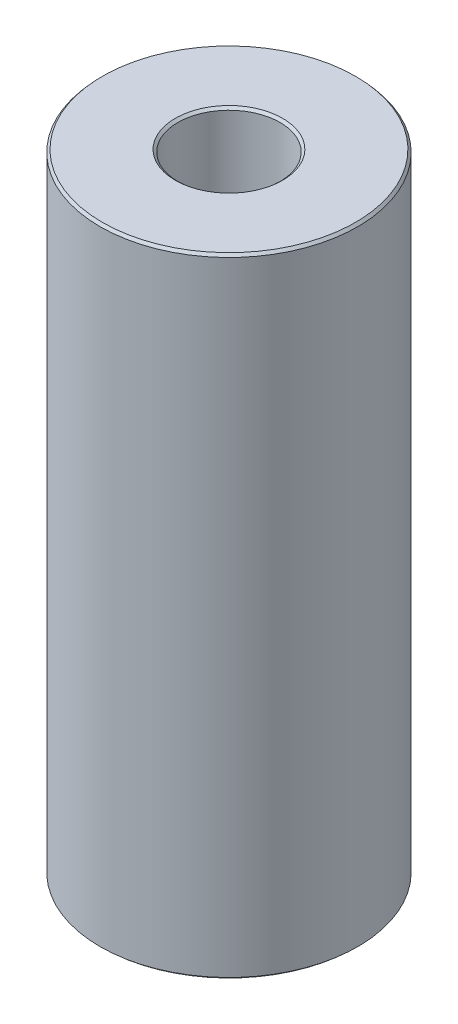
ISO-10303-21;
HEADER;
FILE_DESCRIPTION(('STEP AP214'),'2;1');
FILE_NAME('part.step','',(''),(''),'','','');
FILE_SCHEMA(('AUTOMOTIVE_DESIGN { 1 0 10303 214 1 1 1 1 }'));
ENDSEC;
DATA;
#1=APPLICATION_CONTEXT('core data for automotive mechanical design processes');
#2=APPLICATION_PROTOCOL_DEFINITION('international standard','automotive_design',2000,#1);
#3=PRODUCT_CONTEXT('',#1,'mechanical');
#4=PRODUCT('Part','Part','',(#3));
#5=PRODUCT_RELATED_PRODUCT_CATEGORY('part','',(#4));
#6=PRODUCT_DEFINITION_FORMATION('','',#4);
#7=PRODUCT_DEFINITION_CONTEXT('part definition',#1,'design');
#8=PRODUCT_DEFINITION('design','',#6,#7);
#9=PRODUCT_DEFINITION_SHAPE('','',#8);
#10=(LENGTH_UNIT() NAMED_UNIT(*) SI_UNIT(.MILLI.,.METRE.));
#11=(NAMED_UNIT(*) PLANE_ANGLE_UNIT() SI_UNIT($,.RADIAN.));
#12=(NAMED_UNIT(*) SI_UNIT($,.STERADIAN.) SOLID_ANGLE_UNIT());
#13=UNCERTAINTY_MEASURE_WITH_UNIT(LENGTH_MEASURE(1.E-05),#10,'distance_accuracy_value','');
#14=(GEOMETRIC_REPRESENTATION_CONTEXT(3) GLOBAL_UNCERTAINTY_ASSIGNED_CONTEXT((#13)) GLOBAL_UNIT_ASSIGNED_CONTEXT((#10,
#11,#12)) REPRESENTATION_CONTEXT('',''));
#15=CARTESIAN_POINT('',(0.,0.,0.));
#16=DIRECTION('',(0.,0.,1.));
#17=DIRECTION('',(1.,0.,0.));
#18=AXIS2_PLACEMENT_3D('',#15,#16,#17);
#19=CARTESIAN_POINT('',(0.,268.233558865153,0.));
#20=DIRECTION('',(0.,-1.,0.));
#21=DIRECTION('',(0.,0.,-1.));
#22=AXIS2_PLACEMENT_3D('',#19,#20,#21);
#23=CYLINDRICAL_SURFACE('',#22,55.);
#24=CARTESIAN_POINT('',(0.,0.973628518794178,0.));
#25=DIRECTION('',(0.,1.,0.));
#26=DIRECTION('',(0.,0.,1.));
#27=AXIS2_PLACEMENT_3D('',#24,#25,#26);
#28=CIRCLE('',#27,55.);
#29=CARTESIAN_POINT('',(0.,0.973628518794178,55.));
#30=VERTEX_POINT('',#29);
#31=EDGE_CURVE('E10',#30,#30,#28,.T.);
#32=ORIENTED_EDGE('',*,*,#31,.T.);
#33=EDGE_LOOP('',(#32));
#34=FACE_BOUND('',#33,.T.);
#35=CARTESIAN_POINT('',(0.,267.130493977398,0.));
#36=DIRECTION('',(0.,1.,0.));
#37=DIRECTION('',(0.,0.,1.));
#38=AXIS2_PLACEMENT_3D('',#35,#36,#37);
#39=CIRCLE('',#38,55.);
#40=CARTESIAN_POINT('',(0.,267.130493977398,55.));
#41=VERTEX_POINT('',#40);
#42=EDGE_CURVE('E50',#41,#41,#39,.F.);
#43=ORIENTED_EDGE('',*,*,#42,.T.);
#44=EDGE_LOOP('',(#43));
#45=FACE_BOUND('',#44,.T.);
#46=ADVANCED_FACE('F39',(#34,#45),#23,.T.);
#47=CARTESIAN_POINT('',(0.,268.233558865153,0.));
#48=DIRECTION('',(0.,1.,0.));
#49=DIRECTION('',(0.,0.,1.));
#50=AXIS2_PLACEMENT_3D('',#47,#48,#49);
#51=PLANE('',#50);
#52=CARTESIAN_POINT('',(0.,268.233558865153,0.));
#53=DIRECTION('',(0.,1.,0.));
#54=DIRECTION('',(0.,0.,1.));
#55=AXIS2_PLACEMENT_3D('',#52,#53,#54);
#56=CIRCLE('',#55,22.9226251095553);
#57=CARTESIAN_POINT('',(0.,268.233558865153,22.9226251095553));
#58=VERTEX_POINT('',#57);
#59=EDGE_CURVE('E58',#58,#58,#56,.F.);
#60=ORIENTED_EDGE('',*,*,#59,.T.);
#61=EDGE_LOOP('',(#60));
#62=FACE_BOUND('',#61,.T.);
#63=CARTESIAN_POINT('',(0.,268.233558865153,0.));
#64=DIRECTION('',(0.,1.,0.));
#65=DIRECTION('',(0.,0.,1.));
#66=AXIS2_PLACEMENT_3D('',#63,#64,#65);
#67=CIRCLE('',#66,54.0263714812059);
#68=CARTESIAN_POINT('',(0.,268.233558865153,54.0263714812059));
#69=VERTEX_POINT('',#68);
#70=EDGE_CURVE('E61',#69,#69,#67,.T.);
#71=ORIENTED_EDGE('',*,*,#70,.T.);
#72=EDGE_LOOP('',(#71));
#73=FACE_BOUND('',#72,.T.);
#74=ADVANCED_FACE('F88',(#62,#73),#51,.T.);
#75=CARTESIAN_POINT('',(0.,0.,0.));
#76=DIRECTION('',(0.,1.,0.));
#77=DIRECTION('',(0.,0.,1.));
#78=AXIS2_PLACEMENT_3D('',#75,#76,#77);
#79=PLANE('',#78);
#80=CARTESIAN_POINT('',(0.,0.,0.));
#81=DIRECTION('',(0.,1.,0.));
#82=DIRECTION('',(0.,0.,1.));
#83=AXIS2_PLACEMENT_3D('',#80,#81,#82);
#84=CIRCLE('',#83,22.7931887405946);
#85=CARTESIAN_POINT('',(0.,0.,22.7931887405946));
#86=VERTEX_POINT('',#85);
#87=EDGE_CURVE('E51',#86,#86,#84,.T.);
#88=ORIENTED_EDGE('',*,*,#87,.T.);
#89=EDGE_LOOP('',(#88));
#90=FACE_BOUND('',#89,.T.);
#91=CARTESIAN_POINT('',(0.,0.,0.));
#92=DIRECTION('',(0.,1.,0.));
#93=DIRECTION('',(0.,0.,1.));
#94=AXIS2_PLACEMENT_3D('',#91,#92,#93);
#95=CIRCLE('',#94,53.8969351122452);
#96=CARTESIAN_POINT('',(0.,0.,53.8969351122452));
#97=VERTEX_POINT('',#96);
#98=EDGE_CURVE('E54',#97,#97,#95,.F.);
#99=ORIENTED_EDGE('',*,*,#98,.T.);
#100=EDGE_LOOP('',(#99));
#101=FACE_BOUND('',#100,.T.);
#102=ADVANCED_FACE('F83',(#90,#101),#79,.F.);
#103=CARTESIAN_POINT('',(0.,268.233558865153,0.));
#104=DIRECTION('',(0.,-1.,0.));
#105=DIRECTION('',(0.,0.,-1.));
#106=AXIS2_PLACEMENT_3D('',#103,#104,#105);
#107=CYLINDRICAL_SURFACE('',#106,21.8195602218005);
#108=CARTESIAN_POINT('',(0.,267.259930346359,0.));
#109=DIRECTION('',(0.,1.,0.));
#110=DIRECTION('',(0.,0.,1.));
#111=AXIS2_PLACEMENT_3D('',#108,#109,#110);
#112=CIRCLE('',#111,21.8195602218005);
#113=CARTESIAN_POINT('',(0.,267.259930346359,21.8195602218005));
#114=VERTEX_POINT('',#113);
#115=EDGE_CURVE('E67',#114,#114,#112,.T.);
#116=ORIENTED_EDGE('',*,*,#115,.T.);
#117=EDGE_LOOP('',(#116));
#118=FACE_BOUND('',#117,.T.);
#119=CARTESIAN_POINT('',(0.,1.10306488775475,0.));
#120=DIRECTION('',(0.,1.,0.));
#121=DIRECTION('',(0.,0.,1.));
#122=AXIS2_PLACEMENT_3D('',#119,#120,#121);
#123=CIRCLE('',#122,21.8195602218005);
#124=CARTESIAN_POINT('',(0.,1.10306488775475,21.8195602218005));
#125=VERTEX_POINT('',#124);
#126=EDGE_CURVE('E69',#125,#125,#123,.F.);
#127=ORIENTED_EDGE('',*,*,#126,.T.);
#128=EDGE_LOOP('',(#127));
#129=FACE_BOUND('',#128,.T.);
#130=ADVANCED_FACE('F71',(#118,#129),#107,.F.);
#131=CARTESIAN_POINT('',(0.,267.259930346359,0.));
#132=DIRECTION('',(0.,1.,0.));
#133=DIRECTION('',(0.,0.,1.));
#134=AXIS2_PLACEMENT_3D('',#131,#132,#133);
#135=CONICAL_SURFACE('',#134,21.8195602218005,0.847645747460307);
#136=ORIENTED_EDGE('',*,*,#59,.F.);
#137=EDGE_LOOP('',(#136));
#138=FACE_BOUND('',#137,.T.);
#139=ORIENTED_EDGE('',*,*,#115,.F.);
#140=EDGE_LOOP('',(#139));
#141=FACE_BOUND('',#140,.T.);
#142=ADVANCED_FACE('F77',(#138,#141),#135,.F.);
#143=CARTESIAN_POINT('',(0.,0.,0.));
#144=DIRECTION('',(0.,-1.,0.));
#145=DIRECTION('',(0.,0.,-1.));
#146=AXIS2_PLACEMENT_3D('',#143,#144,#145);
#147=CONICAL_SURFACE('',#146,22.7931887405946,0.723150579334581);
#148=ORIENTED_EDGE('',*,*,#126,.F.);
#149=EDGE_LOOP('',(#148));
#150=FACE_BOUND('',#149,.T.);
#151=ORIENTED_EDGE('',*,*,#87,.F.);
#152=EDGE_LOOP('',(#151));
#153=FACE_BOUND('',#152,.T.);
#154=ADVANCED_FACE('F73',(#150,#153),#147,.F.);
#155=CARTESIAN_POINT('',(0.,0.973628518794178,0.));
#156=DIRECTION('',(0.,1.,0.));
#157=DIRECTION('',(0.,0.,1.));
#158=AXIS2_PLACEMENT_3D('',#155,#156,#157);
#159=CONICAL_SURFACE('',#158,55.,0.847645747460315);
#160=ORIENTED_EDGE('',*,*,#98,.F.);
#161=EDGE_LOOP('',(#160));
#162=FACE_BOUND('',#161,.T.);
#163=ORIENTED_EDGE('',*,*,#31,.F.);
#164=EDGE_LOOP('',(#163));
#165=FACE_BOUND('',#164,.T.);
#166=ADVANCED_FACE('F76',(#162,#165),#159,.T.);
#167=CARTESIAN_POINT('',(0.,268.233558865153,0.));
#168=DIRECTION('',(0.,-1.,0.));
#169=DIRECTION('',(0.,0.,-1.));
#170=AXIS2_PLACEMENT_3D('',#167,#168,#169);
#171=CONICAL_SURFACE('',#170,54.0263714812059,0.723150579334558);
#172=ORIENTED_EDGE('',*,*,#42,.F.);
#173=EDGE_LOOP('',(#172));
#174=FACE_BOUND('',#173,.T.);
#175=ORIENTED_EDGE('',*,*,#70,.F.);
#176=EDGE_LOOP('',(#175));
#177=FACE_BOUND('',#176,.T.);
#178=ADVANCED_FACE('F45',(#174,#177),#171,.T.);
#179=CLOSED_SHELL('',(#46,#74,#102,#130,#142,#154,#166,#178));
#180=MANIFOLD_SOLID_BREP('B2',#179);
#181=ADVANCED_BREP_SHAPE_REPRESENTATION('',(#18,#180),#14);
#182=SHAPE_DEFINITION_REPRESENTATION(#9,#181);
ENDSEC;
END-ISO-10303-21;
